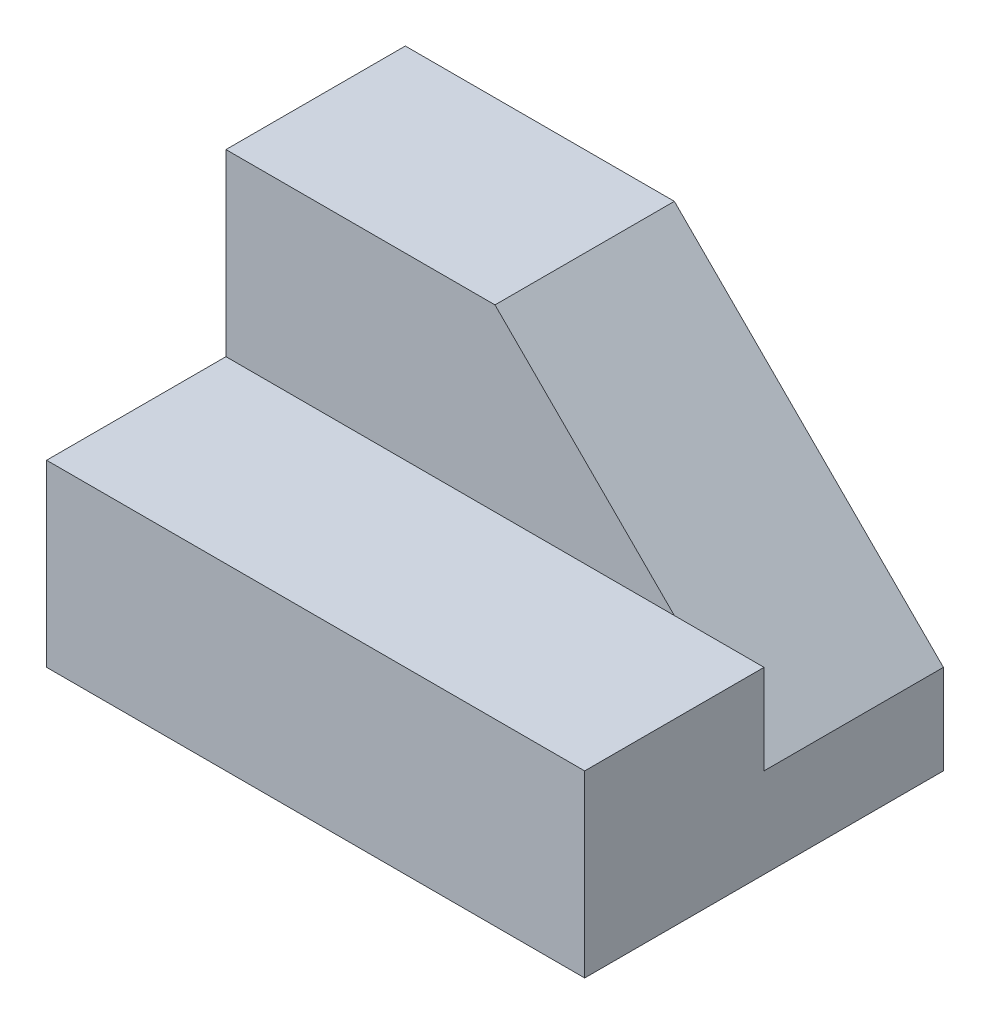
ISO-10303-21;
HEADER;
FILE_DESCRIPTION(('STEP AP214'),'2;1');
FILE_NAME('part.step','',(''),(''),'','','');
FILE_SCHEMA(('AUTOMOTIVE_DESIGN { 1 0 10303 214 1 1 1 1 }'));
ENDSEC;
DATA;
#1=APPLICATION_CONTEXT('core data for automotive mechanical design processes');
#2=APPLICATION_PROTOCOL_DEFINITION('international standard','automotive_design',2000,#1);
#3=PRODUCT_CONTEXT('',#1,'mechanical');
#4=PRODUCT('Part','Part','',(#3));
#5=PRODUCT_RELATED_PRODUCT_CATEGORY('part','',(#4));
#6=PRODUCT_DEFINITION_FORMATION('','',#4);
#7=PRODUCT_DEFINITION_CONTEXT('part definition',#1,'design');
#8=PRODUCT_DEFINITION('design','',#6,#7);
#9=PRODUCT_DEFINITION_SHAPE('','',#8);
#10=(LENGTH_UNIT() NAMED_UNIT(*) SI_UNIT(.MILLI.,.METRE.));
#11=(NAMED_UNIT(*) PLANE_ANGLE_UNIT() SI_UNIT($,.RADIAN.));
#12=(NAMED_UNIT(*) SI_UNIT($,.STERADIAN.) SOLID_ANGLE_UNIT());
#13=UNCERTAINTY_MEASURE_WITH_UNIT(LENGTH_MEASURE(1.E-05),#10,'distance_accuracy_value','');
#14=(GEOMETRIC_REPRESENTATION_CONTEXT(3) GLOBAL_UNCERTAINTY_ASSIGNED_CONTEXT((#13)) GLOBAL_UNIT_ASSIGNED_CONTEXT((#10,
#11,#12)) REPRESENTATION_CONTEXT('',''));
#15=CARTESIAN_POINT('',(0.,0.,0.));
#16=DIRECTION('',(0.,0.,1.));
#17=DIRECTION('',(1.,0.,0.));
#18=AXIS2_PLACEMENT_3D('',#15,#16,#17);
#19=CARTESIAN_POINT('',(0.,10.,0.));
#20=DIRECTION('',(0.,1.,0.));
#21=DIRECTION('',(0.,0.,1.));
#22=AXIS2_PLACEMENT_3D('',#19,#20,#21);
#23=PLANE('',#22);
#24=DIRECTION('',(0.,0.,1.));
#25=VECTOR('',#24,1.);
#26=CARTESIAN_POINT('',(15.,10.,0.));
#27=LINE('',#26,#25);
#28=CARTESIAN_POINT('',(15.,10.,0.));
#29=VERTEX_POINT('',#28);
#30=CARTESIAN_POINT('',(15.,10.,10.));
#31=VERTEX_POINT('',#30);
#32=EDGE_CURVE('E63',#29,#31,#27,.T.);
#33=ORIENTED_EDGE('',*,*,#32,.F.);
#34=DIRECTION('',(-1.,0.,0.));
#35=VECTOR('',#34,1.);
#36=CARTESIAN_POINT('',(0.,10.,0.));
#37=LINE('',#36,#35);
#38=CARTESIAN_POINT('',(10.,10.,0.));
#39=VERTEX_POINT('',#38);
#40=EDGE_CURVE('E91',#29,#39,#37,.T.);
#41=ORIENTED_EDGE('',*,*,#40,.T.);
#42=CARTESIAN_POINT('',(-15.,10.,0.));
#43=VERTEX_POINT('',#42);
#44=EDGE_CURVE('E128',#39,#43,#37,.T.);
#45=ORIENTED_EDGE('',*,*,#44,.T.);
#46=DIRECTION('',(0.,0.,1.));
#47=VECTOR('',#46,1.);
#48=CARTESIAN_POINT('',(-15.,10.,0.));
#49=LINE('',#48,#47);
#50=CARTESIAN_POINT('',(-15.,10.,10.));
#51=VERTEX_POINT('',#50);
#52=EDGE_CURVE('E106',#43,#51,#49,.T.);
#53=ORIENTED_EDGE('',*,*,#52,.T.);
#54=DIRECTION('',(1.,0.,0.));
#55=VECTOR('',#54,1.);
#56=CARTESIAN_POINT('',(0.,10.,10.));
#57=LINE('',#56,#55);
#58=EDGE_CURVE('E99',#51,#31,#57,.T.);
#59=ORIENTED_EDGE('',*,*,#58,.T.);
#60=EDGE_LOOP('',(#33,#41,#45,#53,#59));
#61=FACE_BOUND('',#60,.T.);
#62=ADVANCED_FACE('F39',(#61),#23,.T.);
#63=CARTESIAN_POINT('',(15.,10.,0.));
#64=DIRECTION('',(1.,0.,0.));
#65=DIRECTION('',(0.,0.,-1.));
#66=AXIS2_PLACEMENT_3D('',#63,#64,#65);
#67=PLANE('',#66);
#68=DIRECTION('',(0.,0.,-1.));
#69=VECTOR('',#68,1.);
#70=CARTESIAN_POINT('',(15.,5.,0.));
#71=LINE('',#70,#69);
#72=CARTESIAN_POINT('',(15.,5.,0.));
#73=VERTEX_POINT('',#72);
#74=CARTESIAN_POINT('',(15.,5.,-10.));
#75=VERTEX_POINT('',#74);
#76=EDGE_CURVE('E139',#73,#75,#71,.T.);
#77=ORIENTED_EDGE('',*,*,#76,.F.);
#78=DIRECTION('',(0.,-1.,0.));
#79=VECTOR('',#78,1.);
#80=CARTESIAN_POINT('',(15.,20.,0.));
#81=LINE('',#80,#79);
#82=EDGE_CURVE('E144',#29,#73,#81,.T.);
#83=ORIENTED_EDGE('',*,*,#82,.F.);
#84=ORIENTED_EDGE('',*,*,#32,.T.);
#85=DIRECTION('',(0.,-1.,0.));
#86=VECTOR('',#85,1.);
#87=CARTESIAN_POINT('',(15.,10.,10.));
#88=LINE('',#87,#86);
#89=CARTESIAN_POINT('',(15.,0.,10.));
#90=VERTEX_POINT('',#89);
#91=EDGE_CURVE('E94',#31,#90,#88,.T.);
#92=ORIENTED_EDGE('',*,*,#91,.T.);
#93=DIRECTION('',(0.,0.,1.));
#94=VECTOR('',#93,1.);
#95=CARTESIAN_POINT('',(15.,0.,0.));
#96=LINE('',#95,#94);
#97=CARTESIAN_POINT('',(15.,0.,-10.));
#98=VERTEX_POINT('',#97);
#99=EDGE_CURVE('E83',#98,#90,#96,.T.);
#100=ORIENTED_EDGE('',*,*,#99,.F.);
#101=DIRECTION('',(0.,-1.,0.));
#102=VECTOR('',#101,1.);
#103=CARTESIAN_POINT('',(15.,10.,-10.));
#104=LINE('',#103,#102);
#105=EDGE_CURVE('E11',#75,#98,#104,.T.);
#106=ORIENTED_EDGE('',*,*,#105,.F.);
#107=EDGE_LOOP('',(#77,#83,#84,#92,#100,#106));
#108=FACE_BOUND('',#107,.T.);
#109=ADVANCED_FACE('F41',(#108),#67,.T.);
#110=CARTESIAN_POINT('',(0.,10.,-10.));
#111=DIRECTION('',(0.,0.,-1.));
#112=DIRECTION('',(-1.,0.,0.));
#113=AXIS2_PLACEMENT_3D('',#110,#111,#112);
#114=PLANE('',#113);
#115=DIRECTION('',(-0.707106781186547,0.707106781186547,0.));
#116=VECTOR('',#115,1.);
#117=CARTESIAN_POINT('',(15.,5.,-10.));
#118=LINE('',#117,#116);
#119=CARTESIAN_POINT('',(0.,20.,-10.));
#120=VERTEX_POINT('',#119);
#121=EDGE_CURVE('E54',#75,#120,#118,.T.);
#122=ORIENTED_EDGE('',*,*,#121,.F.);
#123=ORIENTED_EDGE('',*,*,#105,.T.);
#124=DIRECTION('',(1.,0.,0.));
#125=VECTOR('',#124,1.);
#126=CARTESIAN_POINT('',(0.,0.,-10.));
#127=LINE('',#126,#125);
#128=CARTESIAN_POINT('',(-15.,0.,-10.));
#129=VERTEX_POINT('',#128);
#130=EDGE_CURVE('E89',#129,#98,#127,.T.);
#131=ORIENTED_EDGE('',*,*,#130,.F.);
#132=DIRECTION('',(0.,-1.,0.));
#133=VECTOR('',#132,1.);
#134=CARTESIAN_POINT('',(-15.,10.,-10.));
#135=LINE('',#134,#133);
#136=CARTESIAN_POINT('',(-15.,20.,-10.));
#137=VERTEX_POINT('',#136);
#138=EDGE_CURVE('E47',#137,#129,#135,.T.);
#139=ORIENTED_EDGE('',*,*,#138,.F.);
#140=DIRECTION('',(1.,0.,0.));
#141=VECTOR('',#140,1.);
#142=CARTESIAN_POINT('',(0.,20.,-10.));
#143=LINE('',#142,#141);
#144=EDGE_CURVE('E133',#137,#120,#143,.T.);
#145=ORIENTED_EDGE('',*,*,#144,.T.);
#146=EDGE_LOOP('',(#122,#123,#131,#139,#145));
#147=FACE_BOUND('',#146,.T.);
#148=ADVANCED_FACE('F122',(#147),#114,.T.);
#149=CARTESIAN_POINT('',(-15.,10.,0.));
#150=DIRECTION('',(1.,0.,0.));
#151=DIRECTION('',(0.,0.,-1.));
#152=AXIS2_PLACEMENT_3D('',#149,#150,#151);
#153=PLANE('',#152);
#154=DIRECTION('',(0.,0.,1.));
#155=VECTOR('',#154,1.);
#156=CARTESIAN_POINT('',(-15.,0.,0.));
#157=LINE('',#156,#155);
#158=CARTESIAN_POINT('',(-15.,0.,10.));
#159=VERTEX_POINT('',#158);
#160=EDGE_CURVE('E104',#129,#159,#157,.T.);
#161=ORIENTED_EDGE('',*,*,#160,.T.);
#162=DIRECTION('',(0.,-1.,0.));
#163=VECTOR('',#162,1.);
#164=CARTESIAN_POINT('',(-15.,10.,10.));
#165=LINE('',#164,#163);
#166=EDGE_CURVE('E98',#51,#159,#165,.T.);
#167=ORIENTED_EDGE('',*,*,#166,.F.);
#168=ORIENTED_EDGE('',*,*,#52,.F.);
#169=DIRECTION('',(0.,-1.,0.));
#170=VECTOR('',#169,1.);
#171=CARTESIAN_POINT('',(-15.,20.,0.));
#172=LINE('',#171,#170);
#173=CARTESIAN_POINT('',(-15.,20.,0.));
#174=VERTEX_POINT('',#173);
#175=EDGE_CURVE('E129',#174,#43,#172,.T.);
#176=ORIENTED_EDGE('',*,*,#175,.F.);
#177=DIRECTION('',(0.,0.,1.));
#178=VECTOR('',#177,1.);
#179=CARTESIAN_POINT('',(-15.,20.,0.));
#180=LINE('',#179,#178);
#181=EDGE_CURVE('E118',#137,#174,#180,.T.);
#182=ORIENTED_EDGE('',*,*,#181,.F.);
#183=ORIENTED_EDGE('',*,*,#138,.T.);
#184=EDGE_LOOP('',(#161,#167,#168,#176,#182,#183));
#185=FACE_BOUND('',#184,.T.);
#186=ADVANCED_FACE('F114',(#185),#153,.F.);
#187=CARTESIAN_POINT('',(0.,10.,10.));
#188=DIRECTION('',(0.,0.,-1.));
#189=DIRECTION('',(-1.,0.,0.));
#190=AXIS2_PLACEMENT_3D('',#187,#188,#189);
#191=PLANE('',#190);
#192=DIRECTION('',(1.,0.,0.));
#193=VECTOR('',#192,1.);
#194=CARTESIAN_POINT('',(0.,0.,10.));
#195=LINE('',#194,#193);
#196=EDGE_CURVE('E87',#159,#90,#195,.T.);
#197=ORIENTED_EDGE('',*,*,#196,.T.);
#198=ORIENTED_EDGE('',*,*,#91,.F.);
#199=ORIENTED_EDGE('',*,*,#58,.F.);
#200=ORIENTED_EDGE('',*,*,#166,.T.);
#201=EDGE_LOOP('',(#197,#198,#199,#200));
#202=FACE_BOUND('',#201,.T.);
#203=ADVANCED_FACE('F102',(#202),#191,.F.);
#204=CARTESIAN_POINT('',(0.,0.,0.));
#205=DIRECTION('',(0.,1.,0.));
#206=DIRECTION('',(0.,0.,1.));
#207=AXIS2_PLACEMENT_3D('',#204,#205,#206);
#208=PLANE('',#207);
#209=ORIENTED_EDGE('',*,*,#99,.T.);
#210=ORIENTED_EDGE('',*,*,#196,.F.);
#211=ORIENTED_EDGE('',*,*,#160,.F.);
#212=ORIENTED_EDGE('',*,*,#130,.T.);
#213=EDGE_LOOP('',(#209,#210,#211,#212));
#214=FACE_BOUND('',#213,.T.);
#215=ADVANCED_FACE('F84',(#214),#208,.F.);
#216=CARTESIAN_POINT('',(0.,20.,0.));
#217=DIRECTION('',(0.,0.,-1.));
#218=DIRECTION('',(-1.,0.,0.));
#219=AXIS2_PLACEMENT_3D('',#216,#217,#218);
#220=PLANE('',#219);
#221=ORIENTED_EDGE('',*,*,#44,.F.);
#222=DIRECTION('',(-0.707106781186547,0.707106781186547,0.));
#223=VECTOR('',#222,1.);
#224=CARTESIAN_POINT('',(15.,5.,0.));
#225=LINE('',#224,#223);
#226=CARTESIAN_POINT('',(0.,20.,0.));
#227=VERTEX_POINT('',#226);
#228=EDGE_CURVE('E147',#39,#227,#225,.T.);
#229=ORIENTED_EDGE('',*,*,#228,.T.);
#230=DIRECTION('',(1.,0.,0.));
#231=VECTOR('',#230,1.);
#232=CARTESIAN_POINT('',(0.,20.,0.));
#233=LINE('',#232,#231);
#234=EDGE_CURVE('E135',#174,#227,#233,.T.);
#235=ORIENTED_EDGE('',*,*,#234,.F.);
#236=ORIENTED_EDGE('',*,*,#175,.T.);
#237=EDGE_LOOP('',(#221,#229,#235,#236));
#238=FACE_BOUND('',#237,.T.);
#239=ADVANCED_FACE('F159',(#238),#220,.F.);
#240=CARTESIAN_POINT('',(0.,20.,0.));
#241=DIRECTION('',(0.,1.,0.));
#242=DIRECTION('',(0.,0.,1.));
#243=AXIS2_PLACEMENT_3D('',#240,#241,#242);
#244=PLANE('',#243);
#245=DIRECTION('',(0.,0.,-1.));
#246=VECTOR('',#245,1.);
#247=CARTESIAN_POINT('',(0.,20.,0.));
#248=LINE('',#247,#246);
#249=EDGE_CURVE('E138',#227,#120,#248,.T.);
#250=ORIENTED_EDGE('',*,*,#249,.T.);
#251=ORIENTED_EDGE('',*,*,#144,.F.);
#252=ORIENTED_EDGE('',*,*,#181,.T.);
#253=ORIENTED_EDGE('',*,*,#234,.T.);
#254=EDGE_LOOP('',(#250,#251,#252,#253));
#255=FACE_BOUND('',#254,.T.);
#256=ADVANCED_FACE('F166',(#255),#244,.T.);
#257=CARTESIAN_POINT('',(15.,5.,0.));
#258=DIRECTION('',(-0.707106781186548,-0.707106781186548,0.));
#259=DIRECTION('',(0.707106781186548,-0.707106781186548,0.));
#260=AXIS2_PLACEMENT_3D('',#257,#258,#259);
#261=PLANE('',#260);
#262=ORIENTED_EDGE('',*,*,#121,.T.);
#263=ORIENTED_EDGE('',*,*,#249,.F.);
#264=ORIENTED_EDGE('',*,*,#228,.F.);
#265=EDGE_CURVE('E141',#73,#39,#225,.T.);
#266=ORIENTED_EDGE('',*,*,#265,.F.);
#267=ORIENTED_EDGE('',*,*,#76,.T.);
#268=EDGE_LOOP('',(#262,#263,#264,#266,#267));
#269=FACE_BOUND('',#268,.T.);
#270=ADVANCED_FACE('F176',(#269),#261,.F.);
#271=CARTESIAN_POINT('',(0.,0.,0.));
#272=DIRECTION('',(0.,0.,1.));
#273=DIRECTION('',(1.,0.,0.));
#274=AXIS2_PLACEMENT_3D('',#271,#272,#273);
#275=PLANE('',#274);
#276=ORIENTED_EDGE('',*,*,#40,.F.);
#277=ORIENTED_EDGE('',*,*,#82,.T.);
#278=ORIENTED_EDGE('',*,*,#265,.T.);
#279=EDGE_LOOP('',(#276,#277,#278));
#280=FACE_BOUND('',#279,.T.);
#281=ADVANCED_FACE('F177',(#280),#275,.F.);
#282=CLOSED_SHELL('',(#62,#109,#148,#186,#203,#215,#239,#256,#270,#281));
#283=MANIFOLD_SOLID_BREP('B2',#282);
#284=ADVANCED_BREP_SHAPE_REPRESENTATION('',(#18,#283),#14);
#285=SHAPE_DEFINITION_REPRESENTATION(#9,#284);
ENDSEC;
END-ISO-10303-21;
